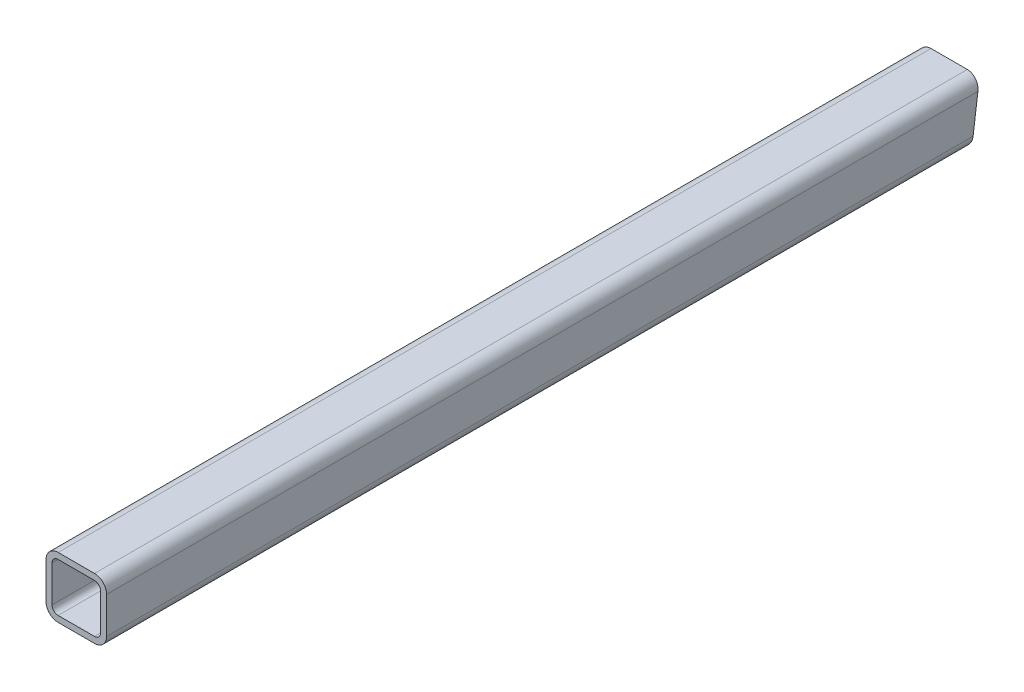
ISO-10303-21;
HEADER;
FILE_DESCRIPTION(('STEP AP214'),'2;1');
FILE_NAME('part.step','',(''),(''),'','','');
FILE_SCHEMA(('AUTOMOTIVE_DESIGN { 1 0 10303 214 1 1 1 1 }'));
ENDSEC;
DATA;
#1=APPLICATION_CONTEXT('core data for automotive mechanical design processes');
#2=APPLICATION_PROTOCOL_DEFINITION('international standard','automotive_design',2000,#1);
#3=PRODUCT_CONTEXT('',#1,'mechanical');
#4=PRODUCT('Part','Part','',(#3));
#5=PRODUCT_RELATED_PRODUCT_CATEGORY('part','',(#4));
#6=PRODUCT_DEFINITION_FORMATION('','',#4);
#7=PRODUCT_DEFINITION_CONTEXT('part definition',#1,'design');
#8=PRODUCT_DEFINITION('design','',#6,#7);
#9=PRODUCT_DEFINITION_SHAPE('','',#8);
#10=(LENGTH_UNIT() NAMED_UNIT(*) SI_UNIT(.MILLI.,.METRE.));
#11=(NAMED_UNIT(*) PLANE_ANGLE_UNIT() SI_UNIT($,.RADIAN.));
#12=(NAMED_UNIT(*) SI_UNIT($,.STERADIAN.) SOLID_ANGLE_UNIT());
#13=UNCERTAINTY_MEASURE_WITH_UNIT(LENGTH_MEASURE(1.E-05),#10,'distance_accuracy_value','');
#14=(GEOMETRIC_REPRESENTATION_CONTEXT(3) GLOBAL_UNCERTAINTY_ASSIGNED_CONTEXT((#13)) GLOBAL_UNIT_ASSIGNED_CONTEXT((#10,
#11,#12)) REPRESENTATION_CONTEXT('',''));
#15=CARTESIAN_POINT('',(0.,0.,0.));
#16=DIRECTION('',(0.,0.,1.));
#17=DIRECTION('',(1.,0.,0.));
#18=AXIS2_PLACEMENT_3D('',#15,#16,#17);
#19=CARTESIAN_POINT('',(-19.05,19.05,457.2));
#20=DIRECTION('',(0.,0.,-1.));
#21=DIRECTION('',(-1.,0.,0.));
#22=AXIS2_PLACEMENT_3D('',#19,#20,#21);
#23=CYLINDRICAL_SURFACE('',#22,12.7);
#24=CARTESIAN_POINT('',(-19.05,19.05,-455.52801328064));
#25=DIRECTION('',(0.,-0.130526192220044,-0.991444861373811));
#26=DIRECTION('',(0.,0.991444861373811,-0.130526192220044));
#27=AXIS2_PLACEMENT_3D('',#24,#25,#26);
#28=ELLIPSE('',#27,12.8095877993679,12.7);
#29=CARTESIAN_POINT('',(-31.75,19.05,-455.52801328064));
#30=VERTEX_POINT('',#29);
#31=CARTESIAN_POINT('',(-19.05,31.75,-457.2));
#32=VERTEX_POINT('',#31);
#33=EDGE_CURVE('E100',#30,#32,#28,.T.);
#34=ORIENTED_EDGE('',*,*,#33,.F.);
#35=DIRECTION('',(0.,0.,-1.));
#36=VECTOR('',#35,1.);
#37=CARTESIAN_POINT('',(-31.75,19.05,457.2));
#38=LINE('',#37,#36);
#39=CARTESIAN_POINT('',(-31.75,19.05,457.2));
#40=VERTEX_POINT('',#39);
#41=EDGE_CURVE('E69',#40,#30,#38,.T.);
#42=ORIENTED_EDGE('',*,*,#41,.F.);
#43=CARTESIAN_POINT('',(-19.05,19.05,457.2));
#44=DIRECTION('',(0.,0.,1.));
#45=DIRECTION('',(1.,0.,0.));
#46=AXIS2_PLACEMENT_3D('',#43,#44,#45);
#47=CIRCLE('',#46,12.7);
#48=CARTESIAN_POINT('',(-19.05,31.75,457.2));
#49=VERTEX_POINT('',#48);
#50=EDGE_CURVE('E276',#49,#40,#47,.T.);
#51=ORIENTED_EDGE('',*,*,#50,.F.);
#52=DIRECTION('',(0.,0.,-1.));
#53=VECTOR('',#52,1.);
#54=CARTESIAN_POINT('',(-19.05,31.75,457.2));
#55=LINE('',#54,#53);
#56=EDGE_CURVE('E12',#49,#32,#55,.T.);
#57=ORIENTED_EDGE('',*,*,#56,.T.);
#58=EDGE_LOOP('',(#34,#42,#51,#57));
#59=FACE_BOUND('',#58,.T.);
#60=ADVANCED_FACE('F60',(#59),#23,.T.);
#61=CARTESIAN_POINT('',(-31.7499999999999,-69.9914213562374,457.2));
#62=DIRECTION('',(-1.,0.,0.));
#63=DIRECTION('',(0.,-1.,0.));
#64=AXIS2_PLACEMENT_3D('',#61,#62,#63);
#65=PLANE('',#64);
#66=ORIENTED_EDGE('',*,*,#41,.T.);
#67=DIRECTION('',(0.,-0.991444861373811,0.130526192220044));
#68=VECTOR('',#67,1.);
#69=CARTESIAN_POINT('',(-31.7499999999999,-186.590111344659,-428.454979017967));
#70=LINE('',#69,#68);
#71=CARTESIAN_POINT('',(-31.75,-19.05,-450.512053122561));
#72=VERTEX_POINT('',#71);
#73=EDGE_CURVE('E108',#30,#72,#70,.T.);
#74=ORIENTED_EDGE('',*,*,#73,.T.);
#75=DIRECTION('',(0.,0.,-1.));
#76=VECTOR('',#75,1.);
#77=CARTESIAN_POINT('',(-31.75,-19.05,457.2));
#78=LINE('',#77,#76);
#79=CARTESIAN_POINT('',(-31.75,-19.05,457.2));
#80=VERTEX_POINT('',#79);
#81=EDGE_CURVE('E195',#80,#72,#78,.T.);
#82=ORIENTED_EDGE('',*,*,#81,.F.);
#83=DIRECTION('',(0.,1.,0.));
#84=VECTOR('',#83,1.);
#85=CARTESIAN_POINT('',(-31.7499999999999,-69.9914213562374,457.2));
#86=LINE('',#85,#84);
#87=EDGE_CURVE('E278',#80,#40,#86,.T.);
#88=ORIENTED_EDGE('',*,*,#87,.T.);
#89=EDGE_LOOP('',(#66,#74,#82,#88));
#90=FACE_BOUND('',#89,.T.);
#91=ADVANCED_FACE('F372',(#90),#65,.T.);
#92=CARTESIAN_POINT('',(-19.05,-19.05,457.2));
#93=DIRECTION('',(0.,0.,-1.));
#94=DIRECTION('',(-1.,0.,0.));
#95=AXIS2_PLACEMENT_3D('',#92,#93,#94);
#96=CYLINDRICAL_SURFACE('',#95,12.7);
#97=CARTESIAN_POINT('',(-19.05,-19.05,-450.512053122561));
#98=DIRECTION('',(0.,-0.130526192220044,-0.991444861373811));
#99=DIRECTION('',(0.,0.991444861373811,-0.130526192220044));
#100=AXIS2_PLACEMENT_3D('',#97,#98,#99);
#101=ELLIPSE('',#100,12.8095877993679,12.7);
#102=CARTESIAN_POINT('',(-19.05,-31.75,-448.840066403201));
#103=VERTEX_POINT('',#102);
#104=EDGE_CURVE('E252',#103,#72,#101,.T.);
#105=ORIENTED_EDGE('',*,*,#104,.F.);
#106=DIRECTION('',(0.,0.,-1.));
#107=VECTOR('',#106,1.);
#108=CARTESIAN_POINT('',(-19.05,-31.75,457.2));
#109=LINE('',#108,#107);
#110=CARTESIAN_POINT('',(-19.05,-31.75,457.2));
#111=VERTEX_POINT('',#110);
#112=EDGE_CURVE('E191',#111,#103,#109,.T.);
#113=ORIENTED_EDGE('',*,*,#112,.F.);
#114=CARTESIAN_POINT('',(-19.05,-19.05,457.2));
#115=DIRECTION('',(0.,0.,1.));
#116=DIRECTION('',(1.,0.,0.));
#117=AXIS2_PLACEMENT_3D('',#114,#115,#116);
#118=CIRCLE('',#117,12.7);
#119=EDGE_CURVE('E281',#80,#111,#118,.T.);
#120=ORIENTED_EDGE('',*,*,#119,.F.);
#121=ORIENTED_EDGE('',*,*,#81,.T.);
#122=EDGE_LOOP('',(#105,#113,#120,#121));
#123=FACE_BOUND('',#122,.T.);
#124=ADVANCED_FACE('F287',(#123),#96,.T.);
#125=CARTESIAN_POINT('',(0.,-31.75,457.2));
#126=DIRECTION('',(0.,1.,0.));
#127=DIRECTION('',(-1.,0.,0.));
#128=AXIS2_PLACEMENT_3D('',#125,#126,#127);
#129=PLANE('',#128);
#130=DIRECTION('',(-1.,0.,0.));
#131=VECTOR('',#130,1.);
#132=CARTESIAN_POINT('',(0.,-31.75,-448.840066403201));
#133=LINE('',#132,#131);
#134=CARTESIAN_POINT('',(19.05,-31.75,-448.840066403201));
#135=VERTEX_POINT('',#134);
#136=EDGE_CURVE('E244',#135,#103,#133,.T.);
#137=ORIENTED_EDGE('',*,*,#136,.F.);
#138=DIRECTION('',(0.,0.,-1.));
#139=VECTOR('',#138,1.);
#140=CARTESIAN_POINT('',(19.05,-31.75,457.2));
#141=LINE('',#140,#139);
#142=CARTESIAN_POINT('',(19.05,-31.75,457.2));
#143=VERTEX_POINT('',#142);
#144=EDGE_CURVE('E170',#143,#135,#141,.T.);
#145=ORIENTED_EDGE('',*,*,#144,.F.);
#146=DIRECTION('',(1.,0.,0.));
#147=VECTOR('',#146,1.);
#148=CARTESIAN_POINT('',(0.,-31.75,457.2));
#149=LINE('',#148,#147);
#150=EDGE_CURVE('E155',#111,#143,#149,.T.);
#151=ORIENTED_EDGE('',*,*,#150,.F.);
#152=ORIENTED_EDGE('',*,*,#112,.T.);
#153=EDGE_LOOP('',(#137,#145,#151,#152));
#154=FACE_BOUND('',#153,.T.);
#155=ADVANCED_FACE('F290',(#154),#129,.F.);
#156=CARTESIAN_POINT('',(19.05,-19.05,457.2));
#157=DIRECTION('',(0.,0.,-1.));
#158=DIRECTION('',(-1.,0.,0.));
#159=AXIS2_PLACEMENT_3D('',#156,#157,#158);
#160=CYLINDRICAL_SURFACE('',#159,12.7);
#161=CARTESIAN_POINT('',(19.05,-19.05,-450.512053122561));
#162=DIRECTION('',(0.,-0.130526192220044,-0.991444861373811));
#163=DIRECTION('',(0.,0.991444861373811,-0.130526192220044));
#164=AXIS2_PLACEMENT_3D('',#161,#162,#163);
#165=ELLIPSE('',#164,12.8095877993679,12.7);
#166=CARTESIAN_POINT('',(31.75,-19.05,-450.512053122561));
#167=VERTEX_POINT('',#166);
#168=EDGE_CURVE('E166',#167,#135,#165,.T.);
#169=ORIENTED_EDGE('',*,*,#168,.F.);
#170=DIRECTION('',(0.,0.,-1.));
#171=VECTOR('',#170,1.);
#172=CARTESIAN_POINT('',(31.75,-19.05,457.2));
#173=LINE('',#172,#171);
#174=CARTESIAN_POINT('',(31.75,-19.05,457.2));
#175=VERTEX_POINT('',#174);
#176=EDGE_CURVE('E162',#175,#167,#173,.T.);
#177=ORIENTED_EDGE('',*,*,#176,.F.);
#178=CARTESIAN_POINT('',(19.05,-19.05,457.2));
#179=DIRECTION('',(0.,0.,1.));
#180=DIRECTION('',(1.,0.,0.));
#181=AXIS2_PLACEMENT_3D('',#178,#179,#180);
#182=CIRCLE('',#181,12.7);
#183=EDGE_CURVE('E149',#143,#175,#182,.T.);
#184=ORIENTED_EDGE('',*,*,#183,.F.);
#185=ORIENTED_EDGE('',*,*,#144,.T.);
#186=EDGE_LOOP('',(#169,#177,#184,#185));
#187=FACE_BOUND('',#186,.T.);
#188=ADVANCED_FACE('F163',(#187),#160,.T.);
#189=CARTESIAN_POINT('',(31.7500000000001,-69.9914213562373,457.2));
#190=DIRECTION('',(1.,0.,0.));
#191=DIRECTION('',(0.,1.,0.));
#192=AXIS2_PLACEMENT_3D('',#189,#190,#191);
#193=PLANE('',#192);
#194=ORIENTED_EDGE('',*,*,#176,.T.);
#195=DIRECTION('',(0.,0.991444861373811,-0.130526192220044));
#196=VECTOR('',#195,1.);
#197=CARTESIAN_POINT('',(31.75,46.7513963709648,-459.174971299536));
#198=LINE('',#197,#196);
#199=CARTESIAN_POINT('',(31.75,19.05,-455.52801328064));
#200=VERTEX_POINT('',#199);
#201=EDGE_CURVE('E319',#167,#200,#198,.T.);
#202=ORIENTED_EDGE('',*,*,#201,.T.);
#203=DIRECTION('',(0.,0.,-1.));
#204=VECTOR('',#203,1.);
#205=CARTESIAN_POINT('',(31.75,19.05,457.2));
#206=LINE('',#205,#204);
#207=CARTESIAN_POINT('',(31.75,19.05,457.2));
#208=VERTEX_POINT('',#207);
#209=EDGE_CURVE('E171',#208,#200,#206,.T.);
#210=ORIENTED_EDGE('',*,*,#209,.F.);
#211=DIRECTION('',(0.,-1.,0.));
#212=VECTOR('',#211,1.);
#213=CARTESIAN_POINT('',(31.7500000000001,-69.9914213562373,457.2));
#214=LINE('',#213,#212);
#215=EDGE_CURVE('E153',#208,#175,#214,.T.);
#216=ORIENTED_EDGE('',*,*,#215,.T.);
#217=EDGE_LOOP('',(#194,#202,#210,#216));
#218=FACE_BOUND('',#217,.T.);
#219=ADVANCED_FACE('F173',(#218),#193,.T.);
#220=CARTESIAN_POINT('',(-19.05,-19.05,457.2));
#221=DIRECTION('',(0.,0.,-1.));
#222=DIRECTION('',(-1.,0.,0.));
#223=AXIS2_PLACEMENT_3D('',#220,#221,#222);
#224=CYLINDRICAL_SURFACE('',#223,6.34999999999999);
#225=DIRECTION('',(0.,0.,-1.));
#226=VECTOR('',#225,1.);
#227=CARTESIAN_POINT('',(-19.05,-25.4,457.2));
#228=LINE('',#227,#226);
#229=CARTESIAN_POINT('',(-19.05,-25.4,457.2));
#230=VERTEX_POINT('',#229);
#231=CARTESIAN_POINT('',(-19.05,-25.4,-449.676059762881));
#232=VERTEX_POINT('',#231);
#233=EDGE_CURVE('E176',#230,#232,#228,.T.);
#234=ORIENTED_EDGE('',*,*,#233,.T.);
#235=CARTESIAN_POINT('',(-19.05,-19.05,-450.512053122561));
#236=DIRECTION('',(0.,-0.130526192220044,-0.991444861373811));
#237=DIRECTION('',(0.,0.991444861373811,-0.130526192220044));
#238=AXIS2_PLACEMENT_3D('',#235,#236,#237);
#239=ELLIPSE('',#238,6.40479389968395,6.34999999999999);
#240=CARTESIAN_POINT('',(-25.4,-19.05,-450.512053122561));
#241=VERTEX_POINT('',#240);
#242=EDGE_CURVE('E77',#232,#241,#239,.T.);
#243=ORIENTED_EDGE('',*,*,#242,.T.);
#244=DIRECTION('',(0.,0.,-1.));
#245=VECTOR('',#244,1.);
#246=CARTESIAN_POINT('',(-25.4,-19.05,457.2));
#247=LINE('',#246,#245);
#248=CARTESIAN_POINT('',(-25.4,-19.05,457.2));
#249=VERTEX_POINT('',#248);
#250=EDGE_CURVE('E64',#249,#241,#247,.T.);
#251=ORIENTED_EDGE('',*,*,#250,.F.);
#252=CARTESIAN_POINT('',(-19.05,-19.05,457.2));
#253=DIRECTION('',(0.,0.,1.));
#254=DIRECTION('',(1.,0.,0.));
#255=AXIS2_PLACEMENT_3D('',#252,#253,#254);
#256=CIRCLE('',#255,6.34999999999999);
#257=EDGE_CURVE('E183',#249,#230,#256,.T.);
#258=ORIENTED_EDGE('',*,*,#257,.T.);
#259=EDGE_LOOP('',(#234,#243,#251,#258));
#260=FACE_BOUND('',#259,.T.);
#261=ADVANCED_FACE('F62',(#260),#224,.F.);
#262=CARTESIAN_POINT('',(-25.3999999999999,-69.9914213562373,457.2));
#263=DIRECTION('',(-1.,0.,0.));
#264=DIRECTION('',(0.,-1.,0.));
#265=AXIS2_PLACEMENT_3D('',#262,#263,#264);
#266=PLANE('',#265);
#267=DIRECTION('',(0.,-0.991444861373811,0.130526192220044));
#268=VECTOR('',#267,1.);
#269=CARTESIAN_POINT('',(-25.3999999999999,-186.590111344659,-428.454979017967));
#270=LINE('',#269,#268);
#271=CARTESIAN_POINT('',(-25.4,19.05,-455.52801328064));
#272=VERTEX_POINT('',#271);
#273=EDGE_CURVE('E234',#272,#241,#270,.T.);
#274=ORIENTED_EDGE('',*,*,#273,.F.);
#275=DIRECTION('',(0.,0.,-1.));
#276=VECTOR('',#275,1.);
#277=CARTESIAN_POINT('',(-25.4,19.05,457.2));
#278=LINE('',#277,#276);
#279=CARTESIAN_POINT('',(-25.4,19.05,457.2));
#280=VERTEX_POINT('',#279);
#281=EDGE_CURVE('E220',#280,#272,#278,.T.);
#282=ORIENTED_EDGE('',*,*,#281,.F.);
#283=DIRECTION('',(0.,1.,0.));
#284=VECTOR('',#283,1.);
#285=CARTESIAN_POINT('',(-25.3999999999999,-69.9914213562373,457.2));
#286=LINE('',#285,#284);
#287=EDGE_CURVE('E235',#249,#280,#286,.T.);
#288=ORIENTED_EDGE('',*,*,#287,.F.);
#289=ORIENTED_EDGE('',*,*,#250,.T.);
#290=EDGE_LOOP('',(#274,#282,#288,#289));
#291=FACE_BOUND('',#290,.T.);
#292=ADVANCED_FACE('F233',(#291),#266,.F.);
#293=CARTESIAN_POINT('',(-19.05,19.05,457.2));
#294=DIRECTION('',(0.,0.,-1.));
#295=DIRECTION('',(-1.,0.,0.));
#296=AXIS2_PLACEMENT_3D('',#293,#294,#295);
#297=CYLINDRICAL_SURFACE('',#296,6.34999999999999);
#298=ORIENTED_EDGE('',*,*,#281,.T.);
#299=CARTESIAN_POINT('',(-19.05,19.05,-455.52801328064));
#300=DIRECTION('',(0.,-0.130526192220044,-0.991444861373811));
#301=DIRECTION('',(0.,0.991444861373811,-0.130526192220044));
#302=AXIS2_PLACEMENT_3D('',#299,#300,#301);
#303=ELLIPSE('',#302,6.40479389968396,6.34999999999999);
#304=CARTESIAN_POINT('',(-19.05,25.4,-456.36400664032));
#305=VERTEX_POINT('',#304);
#306=EDGE_CURVE('E246',#272,#305,#303,.T.);
#307=ORIENTED_EDGE('',*,*,#306,.T.);
#308=DIRECTION('',(0.,0.,-1.));
#309=VECTOR('',#308,1.);
#310=CARTESIAN_POINT('',(-19.05,25.4,457.2));
#311=LINE('',#310,#309);
#312=CARTESIAN_POINT('',(-19.05,25.4,457.2));
#313=VERTEX_POINT('',#312);
#314=EDGE_CURVE('E218',#313,#305,#311,.T.);
#315=ORIENTED_EDGE('',*,*,#314,.F.);
#316=CARTESIAN_POINT('',(-19.05,19.05,457.2));
#317=DIRECTION('',(0.,0.,1.));
#318=DIRECTION('',(1.,0.,0.));
#319=AXIS2_PLACEMENT_3D('',#316,#317,#318);
#320=CIRCLE('',#319,6.34999999999999);
#321=EDGE_CURVE('E258',#313,#280,#320,.T.);
#322=ORIENTED_EDGE('',*,*,#321,.T.);
#323=EDGE_LOOP('',(#298,#307,#315,#322));
#324=FACE_BOUND('',#323,.T.);
#325=ADVANCED_FACE('F343',(#324),#297,.F.);
#326=CARTESIAN_POINT('',(0.,25.4,457.2));
#327=DIRECTION('',(0.,-1.,0.));
#328=DIRECTION('',(1.,0.,0.));
#329=AXIS2_PLACEMENT_3D('',#326,#327,#328);
#330=PLANE('',#329);
#331=ORIENTED_EDGE('',*,*,#314,.T.);
#332=DIRECTION('',(1.,0.,0.));
#333=VECTOR('',#332,1.);
#334=CARTESIAN_POINT('',(0.,25.4,-456.36400664032));
#335=LINE('',#334,#333);
#336=CARTESIAN_POINT('',(19.05,25.4,-456.36400664032));
#337=VERTEX_POINT('',#336);
#338=EDGE_CURVE('E341',#305,#337,#335,.T.);
#339=ORIENTED_EDGE('',*,*,#338,.T.);
#340=DIRECTION('',(0.,0.,-1.));
#341=VECTOR('',#340,1.);
#342=CARTESIAN_POINT('',(19.05,25.4,457.2));
#343=LINE('',#342,#341);
#344=CARTESIAN_POINT('',(19.05,25.4,457.2));
#345=VERTEX_POINT('',#344);
#346=EDGE_CURVE('E215',#345,#337,#343,.T.);
#347=ORIENTED_EDGE('',*,*,#346,.F.);
#348=DIRECTION('',(-1.,0.,0.));
#349=VECTOR('',#348,1.);
#350=CARTESIAN_POINT('',(0.,25.4,457.2));
#351=LINE('',#350,#349);
#352=EDGE_CURVE('E260',#345,#313,#351,.T.);
#353=ORIENTED_EDGE('',*,*,#352,.T.);
#354=EDGE_LOOP('',(#331,#339,#347,#353));
#355=FACE_BOUND('',#354,.T.);
#356=ADVANCED_FACE('F346',(#355),#330,.T.);
#357=CARTESIAN_POINT('',(19.05,19.05,457.2));
#358=DIRECTION('',(0.,0.,-1.));
#359=DIRECTION('',(-1.,0.,0.));
#360=AXIS2_PLACEMENT_3D('',#357,#358,#359);
#361=CYLINDRICAL_SURFACE('',#360,6.34999999999999);
#362=ORIENTED_EDGE('',*,*,#346,.T.);
#363=CARTESIAN_POINT('',(19.05,19.05,-455.52801328064));
#364=DIRECTION('',(0.,-0.130526192220044,-0.991444861373811));
#365=DIRECTION('',(0.,0.991444861373811,-0.130526192220044));
#366=AXIS2_PLACEMENT_3D('',#363,#364,#365);
#367=ELLIPSE('',#366,6.40479389968396,6.34999999999999);
#368=CARTESIAN_POINT('',(25.4,19.05,-455.52801328064));
#369=VERTEX_POINT('',#368);
#370=EDGE_CURVE('E338',#337,#369,#367,.T.);
#371=ORIENTED_EDGE('',*,*,#370,.T.);
#372=DIRECTION('',(0.,0.,-1.));
#373=VECTOR('',#372,1.);
#374=CARTESIAN_POINT('',(25.4,19.05,457.2));
#375=LINE('',#374,#373);
#376=CARTESIAN_POINT('',(25.4,19.05,457.2));
#377=VERTEX_POINT('',#376);
#378=EDGE_CURVE('E212',#377,#369,#375,.T.);
#379=ORIENTED_EDGE('',*,*,#378,.F.);
#380=CARTESIAN_POINT('',(19.05,19.05,457.2));
#381=DIRECTION('',(0.,0.,1.));
#382=DIRECTION('',(1.,0.,0.));
#383=AXIS2_PLACEMENT_3D('',#380,#381,#382);
#384=CIRCLE('',#383,6.34999999999999);
#385=EDGE_CURVE('E263',#377,#345,#384,.T.);
#386=ORIENTED_EDGE('',*,*,#385,.T.);
#387=EDGE_LOOP('',(#362,#371,#379,#386));
#388=FACE_BOUND('',#387,.T.);
#389=ADVANCED_FACE('F351',(#388),#361,.F.);
#390=CARTESIAN_POINT('',(25.4,-69.9914213562373,457.2));
#391=DIRECTION('',(1.,0.,0.));
#392=DIRECTION('',(0.,0.,-1.));
#393=AXIS2_PLACEMENT_3D('',#390,#391,#392);
#394=PLANE('',#393);
#395=DIRECTION('',(0.,0.991444861373811,-0.130526192220044));
#396=VECTOR('',#395,1.);
#397=CARTESIAN_POINT('',(25.4,-186.590111344659,-428.454979017967));
#398=LINE('',#397,#396);
#399=CARTESIAN_POINT('',(25.4,-19.05,-450.512053122561));
#400=VERTEX_POINT('',#399);
#401=EDGE_CURVE('E335',#400,#369,#398,.T.);
#402=ORIENTED_EDGE('',*,*,#401,.F.);
#403=DIRECTION('',(0.,0.,-1.));
#404=VECTOR('',#403,1.);
#405=CARTESIAN_POINT('',(25.4,-19.05,457.2));
#406=LINE('',#405,#404);
#407=CARTESIAN_POINT('',(25.4,-19.05,457.2));
#408=VERTEX_POINT('',#407);
#409=EDGE_CURVE('E208',#408,#400,#406,.T.);
#410=ORIENTED_EDGE('',*,*,#409,.F.);
#411=DIRECTION('',(0.,-1.,0.));
#412=VECTOR('',#411,1.);
#413=CARTESIAN_POINT('',(25.4,-69.9914213562373,457.2));
#414=LINE('',#413,#412);
#415=EDGE_CURVE('E266',#377,#408,#414,.T.);
#416=ORIENTED_EDGE('',*,*,#415,.F.);
#417=ORIENTED_EDGE('',*,*,#378,.T.);
#418=EDGE_LOOP('',(#402,#410,#416,#417));
#419=FACE_BOUND('',#418,.T.);
#420=ADVANCED_FACE('F356',(#419),#394,.F.);
#421=CARTESIAN_POINT('',(19.05,-19.05,457.2));
#422=DIRECTION('',(0.,0.,-1.));
#423=DIRECTION('',(-1.,0.,0.));
#424=AXIS2_PLACEMENT_3D('',#421,#422,#423);
#425=CYLINDRICAL_SURFACE('',#424,6.34999999999999);
#426=ORIENTED_EDGE('',*,*,#409,.T.);
#427=CARTESIAN_POINT('',(19.05,-19.05,-450.512053122561));
#428=DIRECTION('',(0.,-0.130526192220044,-0.991444861373811));
#429=DIRECTION('',(0.,0.991444861373811,-0.130526192220044));
#430=AXIS2_PLACEMENT_3D('',#427,#428,#429);
#431=ELLIPSE('',#430,6.40479389968395,6.34999999999999);
#432=CARTESIAN_POINT('',(19.05,-25.4,-449.676059762881));
#433=VERTEX_POINT('',#432);
#434=EDGE_CURVE('E331',#400,#433,#431,.T.);
#435=ORIENTED_EDGE('',*,*,#434,.T.);
#436=DIRECTION('',(0.,0.,-1.));
#437=VECTOR('',#436,1.);
#438=CARTESIAN_POINT('',(19.05,-25.4,457.2));
#439=LINE('',#438,#437);
#440=CARTESIAN_POINT('',(19.05,-25.4,457.2));
#441=VERTEX_POINT('',#440);
#442=EDGE_CURVE('E204',#441,#433,#439,.T.);
#443=ORIENTED_EDGE('',*,*,#442,.F.);
#444=CARTESIAN_POINT('',(19.05,-19.05,457.2));
#445=DIRECTION('',(0.,0.,1.));
#446=DIRECTION('',(1.,0.,0.));
#447=AXIS2_PLACEMENT_3D('',#444,#445,#446);
#448=CIRCLE('',#447,6.34999999999999);
#449=EDGE_CURVE('E268',#441,#408,#448,.T.);
#450=ORIENTED_EDGE('',*,*,#449,.T.);
#451=EDGE_LOOP('',(#426,#435,#443,#450));
#452=FACE_BOUND('',#451,.T.);
#453=ADVANCED_FACE('F361',(#452),#425,.F.);
#454=CARTESIAN_POINT('',(0.,-25.4,457.2));
#455=DIRECTION('',(0.,1.,0.));
#456=DIRECTION('',(-1.,0.,0.));
#457=AXIS2_PLACEMENT_3D('',#454,#455,#456);
#458=PLANE('',#457);
#459=ORIENTED_EDGE('',*,*,#442,.T.);
#460=DIRECTION('',(-1.,0.,0.));
#461=VECTOR('',#460,1.);
#462=CARTESIAN_POINT('',(0.,-25.4,-449.676059762881));
#463=LINE('',#462,#461);
#464=EDGE_CURVE('E326',#433,#232,#463,.T.);
#465=ORIENTED_EDGE('',*,*,#464,.T.);
#466=ORIENTED_EDGE('',*,*,#233,.F.);
#467=DIRECTION('',(1.,0.,0.));
#468=VECTOR('',#467,1.);
#469=CARTESIAN_POINT('',(0.,-25.4,457.2));
#470=LINE('',#469,#468);
#471=EDGE_CURVE('E271',#230,#441,#470,.T.);
#472=ORIENTED_EDGE('',*,*,#471,.T.);
#473=EDGE_LOOP('',(#459,#465,#466,#472));
#474=FACE_BOUND('',#473,.T.);
#475=ADVANCED_FACE('F360',(#474),#458,.T.);
#476=CARTESIAN_POINT('',(19.05,19.05,457.2));
#477=DIRECTION('',(0.,0.,-1.));
#478=DIRECTION('',(-1.,0.,0.));
#479=AXIS2_PLACEMENT_3D('',#476,#477,#478);
#480=CYLINDRICAL_SURFACE('',#479,12.7);
#481=CARTESIAN_POINT('',(19.05,19.05,-455.52801328064));
#482=DIRECTION('',(0.,-0.130526192220044,-0.991444861373811));
#483=DIRECTION('',(0.,0.991444861373811,-0.130526192220044));
#484=AXIS2_PLACEMENT_3D('',#481,#482,#483);
#485=ELLIPSE('',#484,12.8095877993679,12.7);
#486=CARTESIAN_POINT('',(19.05,31.75,-457.2));
#487=VERTEX_POINT('',#486);
#488=EDGE_CURVE('E322',#487,#200,#485,.T.);
#489=ORIENTED_EDGE('',*,*,#488,.F.);
#490=DIRECTION('',(0.,0.,-1.));
#491=VECTOR('',#490,1.);
#492=CARTESIAN_POINT('',(19.05,31.75,457.2));
#493=LINE('',#492,#491);
#494=CARTESIAN_POINT('',(19.05,31.75,457.2));
#495=VERTEX_POINT('',#494);
#496=EDGE_CURVE('E184',#495,#487,#493,.T.);
#497=ORIENTED_EDGE('',*,*,#496,.F.);
#498=CARTESIAN_POINT('',(19.05,19.05,457.2));
#499=DIRECTION('',(0.,0.,1.));
#500=DIRECTION('',(1.,0.,0.));
#501=AXIS2_PLACEMENT_3D('',#498,#499,#500);
#502=CIRCLE('',#501,12.7);
#503=EDGE_CURVE('E86',#208,#495,#502,.T.);
#504=ORIENTED_EDGE('',*,*,#503,.F.);
#505=ORIENTED_EDGE('',*,*,#209,.T.);
#506=EDGE_LOOP('',(#489,#497,#504,#505));
#507=FACE_BOUND('',#506,.T.);
#508=ADVANCED_FACE('F368',(#507),#480,.T.);
#509=CARTESIAN_POINT('',(0.,31.75,457.2));
#510=DIRECTION('',(0.,-1.,0.));
#511=DIRECTION('',(1.,0.,0.));
#512=AXIS2_PLACEMENT_3D('',#509,#510,#511);
#513=PLANE('',#512);
#514=DIRECTION('',(-1.,0.,0.));
#515=VECTOR('',#514,1.);
#516=CARTESIAN_POINT('',(0.,31.75,-457.2));
#517=LINE('',#516,#515);
#518=EDGE_CURVE('E180',#487,#32,#517,.T.);
#519=ORIENTED_EDGE('',*,*,#518,.T.);
#520=ORIENTED_EDGE('',*,*,#56,.F.);
#521=DIRECTION('',(-1.,0.,0.));
#522=VECTOR('',#521,1.);
#523=CARTESIAN_POINT('',(0.,31.75,457.2));
#524=LINE('',#523,#522);
#525=EDGE_CURVE('E274',#495,#49,#524,.T.);
#526=ORIENTED_EDGE('',*,*,#525,.F.);
#527=ORIENTED_EDGE('',*,*,#496,.T.);
#528=EDGE_LOOP('',(#519,#520,#526,#527));
#529=FACE_BOUND('',#528,.T.);
#530=ADVANCED_FACE('F383',(#529),#513,.F.);
#531=CARTESIAN_POINT('',(0.,-69.9914213562373,457.2));
#532=DIRECTION('',(0.,0.,1.));
#533=DIRECTION('',(1.,0.,0.));
#534=AXIS2_PLACEMENT_3D('',#531,#532,#533);
#535=PLANE('',#534);
#536=ORIENTED_EDGE('',*,*,#257,.F.);
#537=ORIENTED_EDGE('',*,*,#287,.T.);
#538=ORIENTED_EDGE('',*,*,#321,.F.);
#539=ORIENTED_EDGE('',*,*,#352,.F.);
#540=ORIENTED_EDGE('',*,*,#385,.F.);
#541=ORIENTED_EDGE('',*,*,#415,.T.);
#542=ORIENTED_EDGE('',*,*,#449,.F.);
#543=ORIENTED_EDGE('',*,*,#471,.F.);
#544=EDGE_LOOP('',(#536,#537,#538,#539,#540,#541,#542,#543));
#545=FACE_BOUND('',#544,.T.);
#546=ORIENTED_EDGE('',*,*,#525,.T.);
#547=ORIENTED_EDGE('',*,*,#50,.T.);
#548=ORIENTED_EDGE('',*,*,#87,.F.);
#549=ORIENTED_EDGE('',*,*,#119,.T.);
#550=ORIENTED_EDGE('',*,*,#150,.T.);
#551=ORIENTED_EDGE('',*,*,#183,.T.);
#552=ORIENTED_EDGE('',*,*,#215,.F.);
#553=ORIENTED_EDGE('',*,*,#503,.T.);
#554=EDGE_LOOP('',(#546,#547,#548,#549,#550,#551,#552,#553));
#555=FACE_BOUND('',#554,.T.);
#556=ADVANCED_FACE('F151',(#545,#555),#535,.T.);
#557=CARTESIAN_POINT('',(-882.65,46.7513963709643,-459.174971299536));
#558=DIRECTION('',(0.,-0.130526192220044,-0.991444861373811));
#559=DIRECTION('',(0.,0.991444861373811,-0.130526192220044));
#560=AXIS2_PLACEMENT_3D('',#557,#558,#559);
#561=PLANE('',#560);
#562=ORIENTED_EDGE('',*,*,#464,.F.);
#563=ORIENTED_EDGE('',*,*,#434,.F.);
#564=ORIENTED_EDGE('',*,*,#401,.T.);
#565=ORIENTED_EDGE('',*,*,#370,.F.);
#566=ORIENTED_EDGE('',*,*,#338,.F.);
#567=ORIENTED_EDGE('',*,*,#306,.F.);
#568=ORIENTED_EDGE('',*,*,#273,.T.);
#569=ORIENTED_EDGE('',*,*,#242,.F.);
#570=EDGE_LOOP('',(#562,#563,#564,#565,#566,#567,#568,#569));
#571=FACE_BOUND('',#570,.T.);
#572=ORIENTED_EDGE('',*,*,#33,.T.);
#573=ORIENTED_EDGE('',*,*,#518,.F.);
#574=ORIENTED_EDGE('',*,*,#488,.T.);
#575=ORIENTED_EDGE('',*,*,#201,.F.);
#576=ORIENTED_EDGE('',*,*,#168,.T.);
#577=ORIENTED_EDGE('',*,*,#136,.T.);
#578=ORIENTED_EDGE('',*,*,#104,.T.);
#579=ORIENTED_EDGE('',*,*,#73,.F.);
#580=EDGE_LOOP('',(#572,#573,#574,#575,#576,#577,#578,#579));
#581=FACE_BOUND('',#580,.T.);
#582=ADVANCED_FACE('F320',(#571,#581),#561,.T.);
#583=CLOSED_SHELL('',(#60,#91,#124,#155,#188,#219,#261,#292,#325,#356,#389,#420,#453,#475,#508,
#530,#556,#582));
#584=MANIFOLD_SOLID_BREP('B2',#583);
#585=ADVANCED_BREP_SHAPE_REPRESENTATION('',(#18,#584),#14);
#586=SHAPE_DEFINITION_REPRESENTATION(#9,#585);
ENDSEC;
END-ISO-10303-21;
